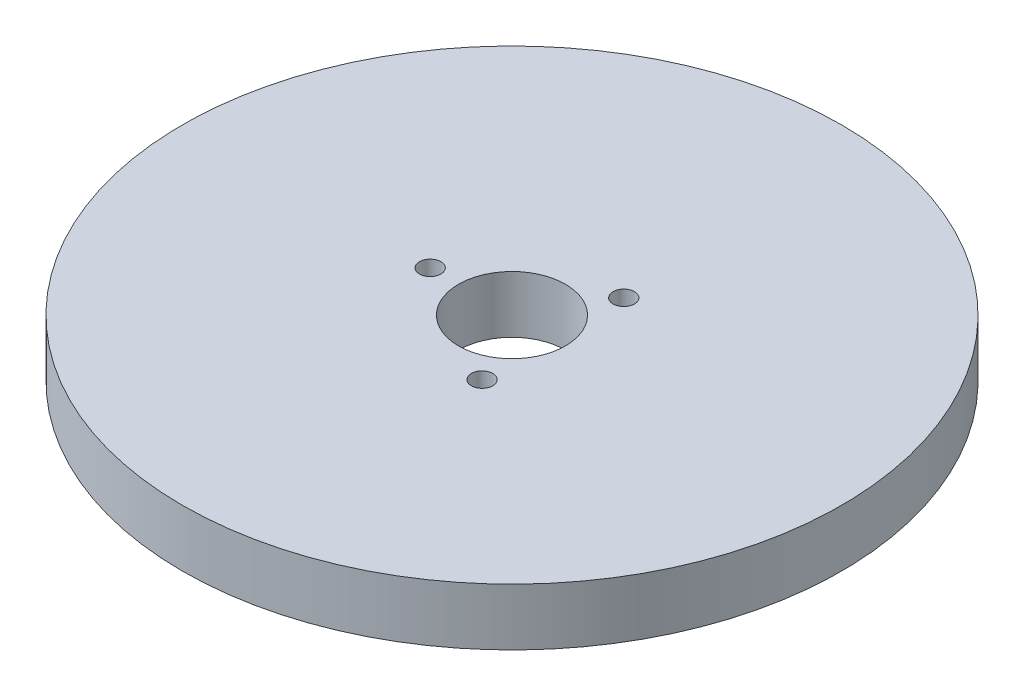
ISO-10303-21;
HEADER;
FILE_DESCRIPTION(('STEP AP214'),'2;1');
FILE_NAME('part.step','',(''),(''),'','','');
FILE_SCHEMA(('AUTOMOTIVE_DESIGN { 1 0 10303 214 1 1 1 1 }'));
ENDSEC;
DATA;
#1=APPLICATION_CONTEXT('core data for automotive mechanical design processes');
#2=APPLICATION_PROTOCOL_DEFINITION('international standard','automotive_design',2000,#1);
#3=PRODUCT_CONTEXT('',#1,'mechanical');
#4=PRODUCT('Part','Part','',(#3));
#5=PRODUCT_RELATED_PRODUCT_CATEGORY('part','',(#4));
#6=PRODUCT_DEFINITION_FORMATION('','',#4);
#7=PRODUCT_DEFINITION_CONTEXT('part definition',#1,'design');
#8=PRODUCT_DEFINITION('design','',#6,#7);
#9=PRODUCT_DEFINITION_SHAPE('','',#8);
#10=(LENGTH_UNIT() NAMED_UNIT(*) SI_UNIT(.MILLI.,.METRE.));
#11=(NAMED_UNIT(*) PLANE_ANGLE_UNIT() SI_UNIT($,.RADIAN.));
#12=(NAMED_UNIT(*) SI_UNIT($,.STERADIAN.) SOLID_ANGLE_UNIT());
#13=UNCERTAINTY_MEASURE_WITH_UNIT(LENGTH_MEASURE(1.E-05),#10,'distance_accuracy_value','');
#14=(GEOMETRIC_REPRESENTATION_CONTEXT(3) GLOBAL_UNCERTAINTY_ASSIGNED_CONTEXT((#13)) GLOBAL_UNIT_ASSIGNED_CONTEXT((#10,
#11,#12)) REPRESENTATION_CONTEXT('',''));
#15=CARTESIAN_POINT('',(0.,0.,0.));
#16=DIRECTION('',(0.,0.,1.));
#17=DIRECTION('',(1.,0.,0.));
#18=AXIS2_PLACEMENT_3D('',#15,#16,#17);
#19=CARTESIAN_POINT('',(0.,16.,0.));
#20=DIRECTION('',(0.,-1.,0.));
#21=DIRECTION('',(0.,0.,-1.));
#22=AXIS2_PLACEMENT_3D('',#19,#20,#21);
#23=CYLINDRICAL_SURFACE('',#22,92.5);
#24=CARTESIAN_POINT('',(0.,16.,0.));
#25=DIRECTION('',(0.,1.,0.));
#26=DIRECTION('',(0.,0.,1.));
#27=AXIS2_PLACEMENT_3D('',#24,#25,#26);
#28=CIRCLE('',#27,92.5);
#29=CARTESIAN_POINT('',(0.,16.,92.5));
#30=VERTEX_POINT('',#29);
#31=EDGE_CURVE('E10',#30,#30,#28,.T.);
#32=ORIENTED_EDGE('',*,*,#31,.F.);
#33=EDGE_LOOP('',(#32));
#34=FACE_BOUND('',#33,.T.);
#35=CARTESIAN_POINT('',(0.,0.,0.));
#36=DIRECTION('',(0.,1.,0.));
#37=DIRECTION('',(0.,0.,1.));
#38=AXIS2_PLACEMENT_3D('',#35,#36,#37);
#39=CIRCLE('',#38,92.5);
#40=CARTESIAN_POINT('',(0.,0.,92.5));
#41=VERTEX_POINT('',#40);
#42=EDGE_CURVE('E37',#41,#41,#39,.T.);
#43=ORIENTED_EDGE('',*,*,#42,.T.);
#44=EDGE_LOOP('',(#43));
#45=FACE_BOUND('',#44,.T.);
#46=ADVANCED_FACE('F40',(#34,#45),#23,.T.);
#47=CARTESIAN_POINT('',(0.,16.,0.));
#48=DIRECTION('',(0.,1.,0.));
#49=DIRECTION('',(0.,0.,1.));
#50=AXIS2_PLACEMENT_3D('',#47,#48,#49);
#51=PLANE('',#50);
#52=CARTESIAN_POINT('',(11.4817884932536,16.,19.8870410320747));
#53=DIRECTION('',(0.,1.,0.));
#54=DIRECTION('',(0.866025403784436,0.,-0.500000000000004));
#55=AXIS2_PLACEMENT_3D('',#52,#53,#54);
#56=CIRCLE('',#55,3.00594823206968);
#57=CARTESIAN_POINT('',(14.0850160246869,16.,18.3840669160399));
#58=VERTEX_POINT('',#57);
#59=EDGE_CURVE('E70',#58,#58,#56,.T.);
#60=ORIENTED_EDGE('',*,*,#59,.F.);
#61=EDGE_LOOP('',(#60));
#62=FACE_BOUND('',#61,.T.);
#63=CARTESIAN_POINT('',(11.4817884932533,16.,-19.8870410320749));
#64=DIRECTION('',(0.,1.,0.));
#65=DIRECTION('',(-0.866025403784443,0.,-0.499999999999992));
#66=AXIS2_PLACEMENT_3D('',#63,#64,#65);
#67=CIRCLE('',#66,3.00594823206968);
#68=CARTESIAN_POINT('',(8.87856096182004,16.,-21.3900151481097));
#69=VERTEX_POINT('',#68);
#70=EDGE_CURVE('E61',#69,#69,#67,.T.);
#71=ORIENTED_EDGE('',*,*,#70,.F.);
#72=EDGE_LOOP('',(#71));
#73=FACE_BOUND('',#72,.T.);
#74=CARTESIAN_POINT('',(-22.963576986507,16.,0.));
#75=DIRECTION('',(0.,1.,0.));
#76=DIRECTION('',(0.,0.,1.));
#77=AXIS2_PLACEMENT_3D('',#74,#75,#76);
#78=CIRCLE('',#77,3.00594823206968);
#79=CARTESIAN_POINT('',(-22.963576986507,16.,3.00594823206968));
#80=VERTEX_POINT('',#79);
#81=EDGE_CURVE('E54',#80,#80,#78,.T.);
#82=ORIENTED_EDGE('',*,*,#81,.F.);
#83=EDGE_LOOP('',(#82));
#84=FACE_BOUND('',#83,.T.);
#85=CARTESIAN_POINT('',(0.,16.,0.));
#86=DIRECTION('',(0.,1.,0.));
#87=DIRECTION('',(0.,0.,1.));
#88=AXIS2_PLACEMENT_3D('',#85,#86,#87);
#89=CIRCLE('',#88,15.);
#90=CARTESIAN_POINT('',(0.,16.,15.));
#91=VERTEX_POINT('',#90);
#92=EDGE_CURVE('E50',#91,#91,#89,.T.);
#93=ORIENTED_EDGE('',*,*,#92,.F.);
#94=EDGE_LOOP('',(#93));
#95=FACE_BOUND('',#94,.T.);
#96=ORIENTED_EDGE('',*,*,#31,.T.);
#97=EDGE_LOOP('',(#96));
#98=FACE_BOUND('',#97,.T.);
#99=ADVANCED_FACE('F85',(#62,#73,#84,#95,#98),#51,.T.);
#100=CARTESIAN_POINT('',(0.,0.,0.));
#101=DIRECTION('',(0.,1.,0.));
#102=DIRECTION('',(0.,0.,1.));
#103=AXIS2_PLACEMENT_3D('',#100,#101,#102);
#104=PLANE('',#103);
#105=CARTESIAN_POINT('',(0.,0.,0.));
#106=DIRECTION('',(0.,1.,0.));
#107=DIRECTION('',(0.,0.,1.));
#108=AXIS2_PLACEMENT_3D('',#105,#106,#107);
#109=CIRCLE('',#108,15.);
#110=CARTESIAN_POINT('',(0.,0.,15.));
#111=VERTEX_POINT('',#110);
#112=EDGE_CURVE('E47',#111,#111,#109,.T.);
#113=ORIENTED_EDGE('',*,*,#112,.T.);
#114=EDGE_LOOP('',(#113));
#115=FACE_BOUND('',#114,.T.);
#116=ORIENTED_EDGE('',*,*,#42,.F.);
#117=EDGE_LOOP('',(#116));
#118=FACE_BOUND('',#117,.T.);
#119=ADVANCED_FACE('F84',(#115,#118),#104,.F.);
#120=CARTESIAN_POINT('',(0.,16.,0.));
#121=DIRECTION('',(0.,-1.,0.));
#122=DIRECTION('',(0.,0.,-1.));
#123=AXIS2_PLACEMENT_3D('',#120,#121,#122);
#124=CYLINDRICAL_SURFACE('',#123,15.);
#125=ORIENTED_EDGE('',*,*,#92,.T.);
#126=EDGE_LOOP('',(#125));
#127=FACE_BOUND('',#126,.T.);
#128=ORIENTED_EDGE('',*,*,#112,.F.);
#129=EDGE_LOOP('',(#128));
#130=FACE_BOUND('',#129,.T.);
#131=ADVANCED_FACE('F91',(#127,#130),#124,.F.);
#132=CARTESIAN_POINT('',(-22.963576986507,5.5225245109211,0.));
#133=DIRECTION('',(0.,1.,0.));
#134=DIRECTION('',(0.,0.,1.));
#135=AXIS2_PLACEMENT_3D('',#132,#133,#134);
#136=CYLINDRICAL_SURFACE('',#135,3.00594823206968);
#137=CARTESIAN_POINT('',(-22.963576986507,5.5225245109211,0.));
#138=DIRECTION('',(0.,1.,0.));
#139=DIRECTION('',(0.,0.,1.));
#140=AXIS2_PLACEMENT_3D('',#137,#138,#139);
#141=CIRCLE('',#140,3.00594823206968);
#142=CARTESIAN_POINT('',(-22.963576986507,5.5225245109211,3.00594823206968));
#143=VERTEX_POINT('',#142);
#144=EDGE_CURVE('E55',#143,#143,#141,.T.);
#145=ORIENTED_EDGE('',*,*,#144,.F.);
#146=EDGE_LOOP('',(#145));
#147=FACE_BOUND('',#146,.T.);
#148=ORIENTED_EDGE('',*,*,#81,.T.);
#149=EDGE_LOOP('',(#148));
#150=FACE_BOUND('',#149,.T.);
#151=ADVANCED_FACE('F96',(#147,#150),#136,.F.);
#152=CARTESIAN_POINT('',(-22.963576986507,5.5225245109211,0.));
#153=DIRECTION('',(0.,1.,0.));
#154=DIRECTION('',(0.,0.,1.));
#155=AXIS2_PLACEMENT_3D('',#152,#153,#154);
#156=PLANE('',#155);
#157=ORIENTED_EDGE('',*,*,#144,.T.);
#158=EDGE_LOOP('',(#157));
#159=FACE_BOUND('',#158,.T.);
#160=ADVANCED_FACE('F127',(#159),#156,.T.);
#161=CARTESIAN_POINT('',(11.4817884932533,5.5225245109211,-19.8870410320749));
#162=DIRECTION('',(0.,1.,0.));
#163=DIRECTION('',(0.,0.,1.));
#164=AXIS2_PLACEMENT_3D('',#161,#162,#163);
#165=CYLINDRICAL_SURFACE('',#164,3.00594823206968);
#166=CARTESIAN_POINT('',(11.4817884932533,5.5225245109211,-19.8870410320749));
#167=DIRECTION('',(0.,1.,0.));
#168=DIRECTION('',(-0.866025403784443,0.,-0.499999999999992));
#169=AXIS2_PLACEMENT_3D('',#166,#167,#168);
#170=CIRCLE('',#169,3.00594823206968);
#171=CARTESIAN_POINT('',(8.87856096182004,5.5225245109211,-21.3900151481097));
#172=VERTEX_POINT('',#171);
#173=EDGE_CURVE('E63',#172,#172,#170,.T.);
#174=ORIENTED_EDGE('',*,*,#173,.F.);
#175=EDGE_LOOP('',(#174));
#176=FACE_BOUND('',#175,.T.);
#177=ORIENTED_EDGE('',*,*,#70,.T.);
#178=EDGE_LOOP('',(#177));
#179=FACE_BOUND('',#178,.T.);
#180=ADVANCED_FACE('F133',(#176,#179),#165,.F.);
#181=CARTESIAN_POINT('',(11.4817884932533,5.5225245109211,-19.8870410320749));
#182=DIRECTION('',(0.,1.,0.));
#183=DIRECTION('',(-0.866025403784443,0.,-0.499999999999992));
#184=AXIS2_PLACEMENT_3D('',#181,#182,#183);
#185=PLANE('',#184);
#186=ORIENTED_EDGE('',*,*,#173,.T.);
#187=EDGE_LOOP('',(#186));
#188=FACE_BOUND('',#187,.T.);
#189=ADVANCED_FACE('F77',(#188),#185,.T.);
#190=CARTESIAN_POINT('',(11.4817884932536,5.5225245109211,19.8870410320747));
#191=DIRECTION('',(0.,1.,0.));
#192=DIRECTION('',(0.,0.,1.));
#193=AXIS2_PLACEMENT_3D('',#190,#191,#192);
#194=CYLINDRICAL_SURFACE('',#193,3.00594823206968);
#195=CARTESIAN_POINT('',(11.4817884932536,5.5225245109211,19.8870410320747));
#196=DIRECTION('',(0.,1.,0.));
#197=DIRECTION('',(0.866025403784436,0.,-0.500000000000004));
#198=AXIS2_PLACEMENT_3D('',#195,#196,#197);
#199=CIRCLE('',#198,3.00594823206968);
#200=CARTESIAN_POINT('',(14.0850160246869,5.5225245109211,18.3840669160399));
#201=VERTEX_POINT('',#200);
#202=EDGE_CURVE('E59',#201,#201,#199,.T.);
#203=ORIENTED_EDGE('',*,*,#202,.F.);
#204=EDGE_LOOP('',(#203));
#205=FACE_BOUND('',#204,.T.);
#206=ORIENTED_EDGE('',*,*,#59,.T.);
#207=EDGE_LOOP('',(#206));
#208=FACE_BOUND('',#207,.T.);
#209=ADVANCED_FACE('F73',(#205,#208),#194,.F.);
#210=CARTESIAN_POINT('',(11.4817884932536,5.5225245109211,19.8870410320747));
#211=DIRECTION('',(0.,1.,0.));
#212=DIRECTION('',(0.866025403784436,0.,-0.500000000000004));
#213=AXIS2_PLACEMENT_3D('',#210,#211,#212);
#214=PLANE('',#213);
#215=ORIENTED_EDGE('',*,*,#202,.T.);
#216=EDGE_LOOP('',(#215));
#217=FACE_BOUND('',#216,.T.);
#218=ADVANCED_FACE('F71',(#217),#214,.T.);
#219=CLOSED_SHELL('',(#46,#99,#119,#131,#151,#160,#180,#189,#209,#218));
#220=MANIFOLD_SOLID_BREP('B2',#219);
#221=ADVANCED_BREP_SHAPE_REPRESENTATION('',(#18,#220),#14);
#222=SHAPE_DEFINITION_REPRESENTATION(#9,#221);
ENDSEC;
END-ISO-10303-21;
